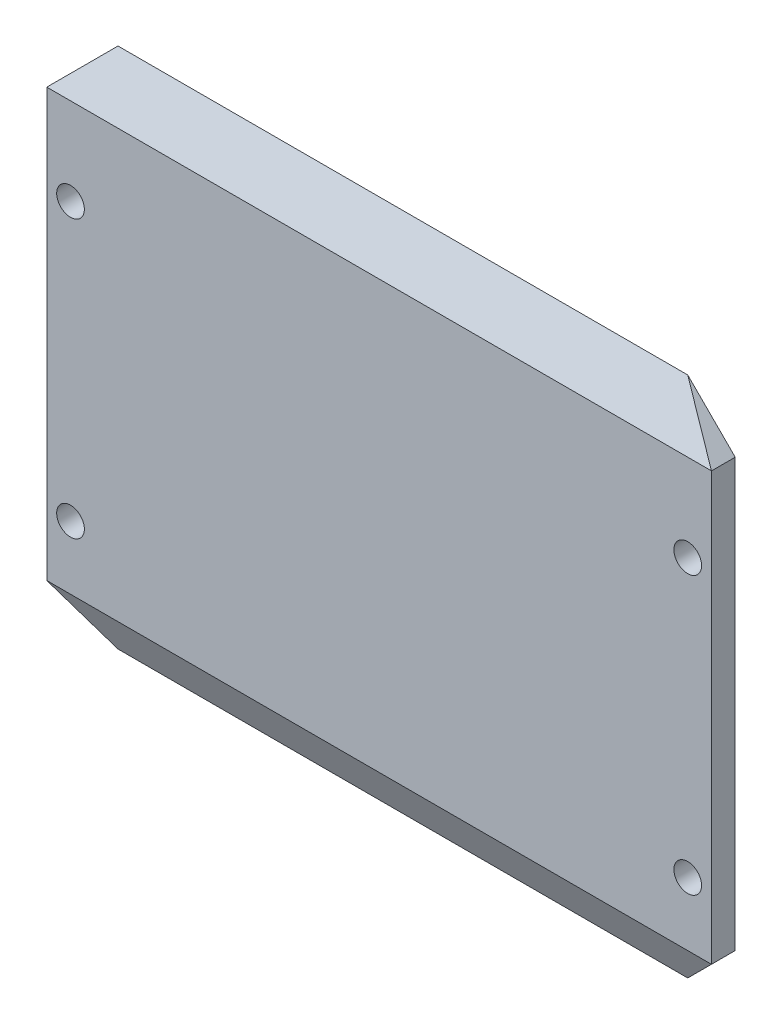
ISO-10303-21;
HEADER;
FILE_DESCRIPTION(('STEP AP214'),'2;1');
FILE_NAME('part.step','',(''),(''),'','','');
FILE_SCHEMA(('AUTOMOTIVE_DESIGN { 1 0 10303 214 1 1 1 1 }'));
ENDSEC;
DATA;
#1=APPLICATION_CONTEXT('core data for automotive mechanical design processes');
#2=APPLICATION_PROTOCOL_DEFINITION('international standard','automotive_design',2000,#1);
#3=PRODUCT_CONTEXT('',#1,'mechanical');
#4=PRODUCT('Part','Part','',(#3));
#5=PRODUCT_RELATED_PRODUCT_CATEGORY('part','',(#4));
#6=PRODUCT_DEFINITION_FORMATION('','',#4);
#7=PRODUCT_DEFINITION_CONTEXT('part definition',#1,'design');
#8=PRODUCT_DEFINITION('design','',#6,#7);
#9=PRODUCT_DEFINITION_SHAPE('','',#8);
#10=(LENGTH_UNIT() NAMED_UNIT(*) SI_UNIT(.MILLI.,.METRE.));
#11=(NAMED_UNIT(*) PLANE_ANGLE_UNIT() SI_UNIT($,.RADIAN.));
#12=(NAMED_UNIT(*) SI_UNIT($,.STERADIAN.) SOLID_ANGLE_UNIT());
#13=UNCERTAINTY_MEASURE_WITH_UNIT(LENGTH_MEASURE(1.E-05),#10,'distance_accuracy_value','');
#14=(GEOMETRIC_REPRESENTATION_CONTEXT(3) GLOBAL_UNCERTAINTY_ASSIGNED_CONTEXT((#13)) GLOBAL_UNIT_ASSIGNED_CONTEXT((#10,
#11,#12)) REPRESENTATION_CONTEXT('',''));
#15=CARTESIAN_POINT('',(0.,0.,0.));
#16=DIRECTION('',(0.,0.,1.));
#17=DIRECTION('',(1.,0.,0.));
#18=AXIS2_PLACEMENT_3D('',#15,#16,#17);
#19=CARTESIAN_POINT('',(42.,-33.,3.));
#20=DIRECTION('',(-1.,0.,0.));
#21=DIRECTION('',(0.,0.,1.));
#22=AXIS2_PLACEMENT_3D('',#19,#20,#21);
#23=PLANE('',#22);
#24=DIRECTION('',(0.,1.,0.));
#25=VECTOR('',#24,1.);
#26=CARTESIAN_POINT('',(42.,-33.,0.));
#27=LINE('',#26,#25);
#28=CARTESIAN_POINT('',(42.,-27.,0.));
#29=VERTEX_POINT('',#28);
#30=CARTESIAN_POINT('',(42.,27.,0.));
#31=VERTEX_POINT('',#30);
#32=EDGE_CURVE('E117',#29,#31,#27,.T.);
#33=ORIENTED_EDGE('',*,*,#32,.T.);
#34=DIRECTION('',(0.,0.,1.));
#35=VECTOR('',#34,1.);
#36=CARTESIAN_POINT('',(42.,27.,3.));
#37=LINE('',#36,#35);
#38=CARTESIAN_POINT('',(42.,27.,3.));
#39=VERTEX_POINT('',#38);
#40=EDGE_CURVE('E129',#31,#39,#37,.T.);
#41=ORIENTED_EDGE('',*,*,#40,.T.);
#42=DIRECTION('',(0.,1.,0.));
#43=VECTOR('',#42,1.);
#44=CARTESIAN_POINT('',(42.,-33.,3.));
#45=LINE('',#44,#43);
#46=CARTESIAN_POINT('',(42.,-27.,3.));
#47=VERTEX_POINT('',#46);
#48=EDGE_CURVE('E115',#47,#39,#45,.T.);
#49=ORIENTED_EDGE('',*,*,#48,.F.);
#50=DIRECTION('',(0.,0.,-1.));
#51=VECTOR('',#50,1.);
#52=CARTESIAN_POINT('',(42.,-27.,3.));
#53=LINE('',#52,#51);
#54=EDGE_CURVE('E95',#47,#29,#53,.T.);
#55=ORIENTED_EDGE('',*,*,#54,.T.);
#56=EDGE_LOOP('',(#33,#41,#49,#55));
#57=FACE_BOUND('',#56,.T.);
#58=ADVANCED_FACE('F33',(#57),#23,.F.);
#59=CARTESIAN_POINT('',(-42.,-33.,3.));
#60=DIRECTION('',(1.,0.,0.));
#61=DIRECTION('',(0.,0.,-1.));
#62=AXIS2_PLACEMENT_3D('',#59,#60,#61);
#63=PLANE('',#62);
#64=DIRECTION('',(0.,-1.,0.));
#65=VECTOR('',#64,1.);
#66=CARTESIAN_POINT('',(-42.,-33.,3.));
#67=LINE('',#66,#65);
#68=CARTESIAN_POINT('',(-42.,27.,3.));
#69=VERTEX_POINT('',#68);
#70=CARTESIAN_POINT('',(-42.,-27.,3.));
#71=VERTEX_POINT('',#70);
#72=EDGE_CURVE('E106',#69,#71,#67,.T.);
#73=ORIENTED_EDGE('',*,*,#72,.F.);
#74=DIRECTION('',(0.,0.,-1.));
#75=VECTOR('',#74,1.);
#76=CARTESIAN_POINT('',(-42.,27.,3.));
#77=LINE('',#76,#75);
#78=CARTESIAN_POINT('',(-42.,27.,0.));
#79=VERTEX_POINT('',#78);
#80=EDGE_CURVE('E89',#69,#79,#77,.T.);
#81=ORIENTED_EDGE('',*,*,#80,.T.);
#82=DIRECTION('',(0.,-1.,0.));
#83=VECTOR('',#82,1.);
#84=CARTESIAN_POINT('',(-42.,-33.,0.));
#85=LINE('',#84,#83);
#86=CARTESIAN_POINT('',(-42.,-27.,0.));
#87=VERTEX_POINT('',#86);
#88=EDGE_CURVE('E103',#79,#87,#85,.T.);
#89=ORIENTED_EDGE('',*,*,#88,.T.);
#90=DIRECTION('',(0.,0.,1.));
#91=VECTOR('',#90,1.);
#92=CARTESIAN_POINT('',(-42.,-27.,3.));
#93=LINE('',#92,#91);
#94=EDGE_CURVE('E108',#87,#71,#93,.T.);
#95=ORIENTED_EDGE('',*,*,#94,.T.);
#96=EDGE_LOOP('',(#73,#81,#89,#95));
#97=FACE_BOUND('',#96,.T.);
#98=ADVANCED_FACE('F101',(#97),#63,.F.);
#99=CARTESIAN_POINT('',(0.,0.,3.));
#100=DIRECTION('',(0.,0.,-1.));
#101=DIRECTION('',(-1.,0.,0.));
#102=AXIS2_PLACEMENT_3D('',#99,#100,#101);
#103=PLANE('',#102);
#104=CARTESIAN_POINT('',(39.,-19.,3.));
#105=DIRECTION('',(0.,0.,1.));
#106=DIRECTION('',(-1.,0.,0.));
#107=AXIS2_PLACEMENT_3D('',#104,#105,#106);
#108=CIRCLE('',#107,1.75);
#109=CARTESIAN_POINT('',(37.25,-19.,3.));
#110=VERTEX_POINT('',#109);
#111=EDGE_CURVE('E175',#110,#110,#108,.T.);
#112=ORIENTED_EDGE('',*,*,#111,.F.);
#113=EDGE_LOOP('',(#112));
#114=FACE_BOUND('',#113,.T.);
#115=CARTESIAN_POINT('',(39.,16.,3.));
#116=DIRECTION('',(0.,0.,1.));
#117=DIRECTION('',(1.,0.,0.));
#118=AXIS2_PLACEMENT_3D('',#115,#116,#117);
#119=CIRCLE('',#118,1.75);
#120=CARTESIAN_POINT('',(40.75,16.,3.));
#121=VERTEX_POINT('',#120);
#122=EDGE_CURVE('E169',#121,#121,#119,.T.);
#123=ORIENTED_EDGE('',*,*,#122,.F.);
#124=EDGE_LOOP('',(#123));
#125=FACE_BOUND('',#124,.T.);
#126=CARTESIAN_POINT('',(-39.,16.,3.));
#127=DIRECTION('',(0.,0.,1.));
#128=DIRECTION('',(-1.,0.,0.));
#129=AXIS2_PLACEMENT_3D('',#126,#127,#128);
#130=CIRCLE('',#129,1.75);
#131=CARTESIAN_POINT('',(-40.75,16.,3.));
#132=VERTEX_POINT('',#131);
#133=EDGE_CURVE('E163',#132,#132,#130,.T.);
#134=ORIENTED_EDGE('',*,*,#133,.F.);
#135=EDGE_LOOP('',(#134));
#136=FACE_BOUND('',#135,.T.);
#137=CARTESIAN_POINT('',(-39.,-19.,3.));
#138=DIRECTION('',(0.,0.,1.));
#139=DIRECTION('',(1.,0.,0.));
#140=AXIS2_PLACEMENT_3D('',#137,#138,#139);
#141=CIRCLE('',#140,1.75);
#142=CARTESIAN_POINT('',(-37.25,-19.,3.));
#143=VERTEX_POINT('',#142);
#144=EDGE_CURVE('E156',#143,#143,#141,.T.);
#145=ORIENTED_EDGE('',*,*,#144,.F.);
#146=EDGE_LOOP('',(#145));
#147=FACE_BOUND('',#146,.T.);
#148=ORIENTED_EDGE('',*,*,#48,.T.);
#149=DIRECTION('',(-1.,0.,0.));
#150=VECTOR('',#149,1.);
#151=CARTESIAN_POINT('',(0.,26.9999999999999,3.));
#152=LINE('',#151,#150);
#153=EDGE_CURVE('E133',#39,#69,#152,.T.);
#154=ORIENTED_EDGE('',*,*,#153,.T.);
#155=ORIENTED_EDGE('',*,*,#72,.T.);
#156=DIRECTION('',(1.,0.,0.));
#157=VECTOR('',#156,1.);
#158=CARTESIAN_POINT('',(0.,-27.,3.));
#159=LINE('',#158,#157);
#160=EDGE_CURVE('E131',#71,#47,#159,.T.);
#161=ORIENTED_EDGE('',*,*,#160,.T.);
#162=EDGE_LOOP('',(#148,#154,#155,#161));
#163=FACE_BOUND('',#162,.T.);
#164=ADVANCED_FACE('F147',(#114,#125,#136,#147,#163),#103,.F.);
#165=CARTESIAN_POINT('',(0.,0.,0.));
#166=DIRECTION('',(0.,0.,-1.));
#167=DIRECTION('',(-1.,0.,0.));
#168=AXIS2_PLACEMENT_3D('',#165,#166,#167);
#169=PLANE('',#168);
#170=CARTESIAN_POINT('',(39.,-19.,0.));
#171=DIRECTION('',(0.,0.,1.));
#172=DIRECTION('',(-1.,0.,0.));
#173=AXIS2_PLACEMENT_3D('',#170,#171,#172);
#174=CIRCLE('',#173,1.75);
#175=CARTESIAN_POINT('',(37.25,-19.,0.));
#176=VERTEX_POINT('',#175);
#177=EDGE_CURVE('E161',#176,#176,#174,.T.);
#178=ORIENTED_EDGE('',*,*,#177,.T.);
#179=EDGE_LOOP('',(#178));
#180=FACE_BOUND('',#179,.T.);
#181=CARTESIAN_POINT('',(39.,16.,0.));
#182=DIRECTION('',(0.,0.,1.));
#183=DIRECTION('',(1.,0.,0.));
#184=AXIS2_PLACEMENT_3D('',#181,#182,#183);
#185=CIRCLE('',#184,1.75);
#186=CARTESIAN_POINT('',(40.75,16.,0.));
#187=VERTEX_POINT('',#186);
#188=EDGE_CURVE('E172',#187,#187,#185,.T.);
#189=ORIENTED_EDGE('',*,*,#188,.T.);
#190=EDGE_LOOP('',(#189));
#191=FACE_BOUND('',#190,.T.);
#192=CARTESIAN_POINT('',(-39.,16.,0.));
#193=DIRECTION('',(0.,0.,1.));
#194=DIRECTION('',(-1.,0.,0.));
#195=AXIS2_PLACEMENT_3D('',#192,#193,#194);
#196=CIRCLE('',#195,1.75);
#197=CARTESIAN_POINT('',(-40.75,16.,0.));
#198=VERTEX_POINT('',#197);
#199=EDGE_CURVE('E166',#198,#198,#196,.T.);
#200=ORIENTED_EDGE('',*,*,#199,.T.);
#201=EDGE_LOOP('',(#200));
#202=FACE_BOUND('',#201,.T.);
#203=CARTESIAN_POINT('',(-39.,-19.,0.));
#204=DIRECTION('',(0.,0.,1.));
#205=DIRECTION('',(1.,0.,0.));
#206=AXIS2_PLACEMENT_3D('',#203,#204,#205);
#207=CIRCLE('',#206,1.75);
#208=CARTESIAN_POINT('',(-37.25,-19.,0.));
#209=VERTEX_POINT('',#208);
#210=EDGE_CURVE('E153',#209,#209,#207,.T.);
#211=ORIENTED_EDGE('',*,*,#210,.T.);
#212=EDGE_LOOP('',(#211));
#213=FACE_BOUND('',#212,.T.);
#214=ORIENTED_EDGE('',*,*,#88,.F.);
#215=DIRECTION('',(-0.707106781186548,-0.707106781186548,0.));
#216=VECTOR('',#215,1.);
#217=CARTESIAN_POINT('',(-34.5,34.5,0.));
#218=LINE('',#217,#216);
#219=CARTESIAN_POINT('',(-36.,33.,0.));
#220=VERTEX_POINT('',#219);
#221=EDGE_CURVE('E86',#79,#220,#218,.F.);
#222=ORIENTED_EDGE('',*,*,#221,.T.);
#223=DIRECTION('',(-1.,0.,0.));
#224=VECTOR('',#223,1.);
#225=CARTESIAN_POINT('',(-42.,33.,0.));
#226=LINE('',#225,#224);
#227=CARTESIAN_POINT('',(36.,33.,0.));
#228=VERTEX_POINT('',#227);
#229=EDGE_CURVE('E113',#228,#220,#226,.T.);
#230=ORIENTED_EDGE('',*,*,#229,.F.);
#231=DIRECTION('',(-0.707106781186548,0.707106781186548,0.));
#232=VECTOR('',#231,1.);
#233=CARTESIAN_POINT('',(34.5,34.5,0.));
#234=LINE('',#233,#232);
#235=EDGE_CURVE('E96',#228,#31,#234,.F.);
#236=ORIENTED_EDGE('',*,*,#235,.T.);
#237=ORIENTED_EDGE('',*,*,#32,.F.);
#238=DIRECTION('',(0.707106781186548,0.707106781186548,0.));
#239=VECTOR('',#238,1.);
#240=CARTESIAN_POINT('',(34.5,-34.5,0.));
#241=LINE('',#240,#239);
#242=CARTESIAN_POINT('',(36.,-33.,0.));
#243=VERTEX_POINT('',#242);
#244=EDGE_CURVE('E123',#29,#243,#241,.F.);
#245=ORIENTED_EDGE('',*,*,#244,.T.);
#246=DIRECTION('',(1.,0.,0.));
#247=VECTOR('',#246,1.);
#248=CARTESIAN_POINT('',(-42.,-33.,0.));
#249=LINE('',#248,#247);
#250=CARTESIAN_POINT('',(-36.,-33.,0.));
#251=VERTEX_POINT('',#250);
#252=EDGE_CURVE('E112',#251,#243,#249,.T.);
#253=ORIENTED_EDGE('',*,*,#252,.F.);
#254=DIRECTION('',(0.707106781186548,-0.707106781186548,0.));
#255=VECTOR('',#254,1.);
#256=CARTESIAN_POINT('',(-34.5,-34.5,0.));
#257=LINE('',#256,#255);
#258=EDGE_CURVE('E107',#251,#87,#257,.F.);
#259=ORIENTED_EDGE('',*,*,#258,.T.);
#260=EDGE_LOOP('',(#214,#222,#230,#236,#237,#245,#253,#259));
#261=FACE_BOUND('',#260,.T.);
#262=ADVANCED_FACE('F110',(#180,#191,#202,#213,#261),#169,.T.);
#263=CARTESIAN_POINT('',(-42.,27.,3.));
#264=DIRECTION('',(0.707106781186547,-0.707106781186547,0.));
#265=DIRECTION('',(0.,0.,-1.));
#266=AXIS2_PLACEMENT_3D('',#263,#264,#265);
#267=PLANE('',#266);
#268=ORIENTED_EDGE('',*,*,#80,.F.);
#269=DIRECTION('',(0.666666666666667,0.666666666666667,-0.333333333333333));
#270=VECTOR('',#269,1.);
#271=CARTESIAN_POINT('',(-42.,27.,2.99999999999998));
#272=LINE('',#271,#270);
#273=EDGE_CURVE('E90',#69,#220,#272,.T.);
#274=ORIENTED_EDGE('',*,*,#273,.T.);
#275=ORIENTED_EDGE('',*,*,#221,.F.);
#276=EDGE_LOOP('',(#268,#274,#275));
#277=FACE_BOUND('',#276,.T.);
#278=ADVANCED_FACE('F88',(#277),#267,.F.);
#279=CARTESIAN_POINT('',(36.,33.,3.));
#280=DIRECTION('',(-0.707106781186547,-0.707106781186547,0.));
#281=DIRECTION('',(0.,0.,-1.));
#282=AXIS2_PLACEMENT_3D('',#279,#280,#281);
#283=PLANE('',#282);
#284=ORIENTED_EDGE('',*,*,#235,.F.);
#285=DIRECTION('',(0.666666666666667,-0.666666666666667,0.333333333333333));
#286=VECTOR('',#285,1.);
#287=CARTESIAN_POINT('',(36.6666666666667,32.3333333333333,0.333333333333317));
#288=LINE('',#287,#286);
#289=EDGE_CURVE('E48',#228,#39,#288,.T.);
#290=ORIENTED_EDGE('',*,*,#289,.T.);
#291=ORIENTED_EDGE('',*,*,#40,.F.);
#292=EDGE_LOOP('',(#284,#290,#291));
#293=FACE_BOUND('',#292,.T.);
#294=ADVANCED_FACE('F221',(#293),#283,.F.);
#295=CARTESIAN_POINT('',(42.,-27.,3.));
#296=DIRECTION('',(-0.707106781186547,0.707106781186547,0.));
#297=DIRECTION('',(0.,0.,-1.));
#298=AXIS2_PLACEMENT_3D('',#295,#296,#297);
#299=PLANE('',#298);
#300=ORIENTED_EDGE('',*,*,#54,.F.);
#301=DIRECTION('',(-0.666666666666667,-0.666666666666667,-0.333333333333333));
#302=VECTOR('',#301,1.);
#303=CARTESIAN_POINT('',(42.,-27.,2.99999999999999));
#304=LINE('',#303,#302);
#305=EDGE_CURVE('E41',#47,#243,#304,.T.);
#306=ORIENTED_EDGE('',*,*,#305,.T.);
#307=ORIENTED_EDGE('',*,*,#244,.F.);
#308=EDGE_LOOP('',(#300,#306,#307));
#309=FACE_BOUND('',#308,.T.);
#310=ADVANCED_FACE('F139',(#309),#299,.F.);
#311=CARTESIAN_POINT('',(-36.,-33.,3.));
#312=DIRECTION('',(0.707106781186547,0.707106781186547,0.));
#313=DIRECTION('',(0.,0.,-1.));
#314=AXIS2_PLACEMENT_3D('',#311,#312,#313);
#315=PLANE('',#314);
#316=ORIENTED_EDGE('',*,*,#258,.F.);
#317=DIRECTION('',(-0.666666666666667,0.666666666666667,0.333333333333333));
#318=VECTOR('',#317,1.);
#319=CARTESIAN_POINT('',(-36.6666666666667,-32.3333333333333,0.33333333333333));
#320=LINE('',#319,#318);
#321=EDGE_CURVE('E11',#251,#71,#320,.T.);
#322=ORIENTED_EDGE('',*,*,#321,.T.);
#323=ORIENTED_EDGE('',*,*,#94,.F.);
#324=EDGE_LOOP('',(#316,#322,#323));
#325=FACE_BOUND('',#324,.T.);
#326=ADVANCED_FACE('F144',(#325),#315,.F.);
#327=CARTESIAN_POINT('',(0.,26.9999999999999,3.));
#328=DIRECTION('',(0.,-0.447213595499957,-0.894427190999916));
#329=DIRECTION('',(-1.,0.,0.));
#330=AXIS2_PLACEMENT_3D('',#327,#328,#329);
#331=PLANE('',#330);
#332=ORIENTED_EDGE('',*,*,#289,.F.);
#333=ORIENTED_EDGE('',*,*,#229,.T.);
#334=ORIENTED_EDGE('',*,*,#273,.F.);
#335=ORIENTED_EDGE('',*,*,#153,.F.);
#336=EDGE_LOOP('',(#332,#333,#334,#335));
#337=FACE_BOUND('',#336,.T.);
#338=ADVANCED_FACE('F210',(#337),#331,.F.);
#339=CARTESIAN_POINT('',(0.,-27.,3.));
#340=DIRECTION('',(0.,0.447213595499957,-0.894427190999916));
#341=DIRECTION('',(1.,0.,0.));
#342=AXIS2_PLACEMENT_3D('',#339,#340,#341);
#343=PLANE('',#342);
#344=ORIENTED_EDGE('',*,*,#321,.F.);
#345=ORIENTED_EDGE('',*,*,#252,.T.);
#346=ORIENTED_EDGE('',*,*,#305,.F.);
#347=ORIENTED_EDGE('',*,*,#160,.F.);
#348=EDGE_LOOP('',(#344,#345,#346,#347));
#349=FACE_BOUND('',#348,.T.);
#350=ADVANCED_FACE('F35',(#349),#343,.F.);
#351=CARTESIAN_POINT('',(-39.,-19.,0.));
#352=DIRECTION('',(0.,0.,1.));
#353=DIRECTION('',(1.,0.,0.));
#354=AXIS2_PLACEMENT_3D('',#351,#352,#353);
#355=CYLINDRICAL_SURFACE('',#354,1.75);
#356=ORIENTED_EDGE('',*,*,#210,.F.);
#357=EDGE_LOOP('',(#356));
#358=FACE_BOUND('',#357,.T.);
#359=ORIENTED_EDGE('',*,*,#144,.T.);
#360=EDGE_LOOP('',(#359));
#361=FACE_BOUND('',#360,.T.);
#362=ADVANCED_FACE('F199',(#358,#361),#355,.F.);
#363=CARTESIAN_POINT('',(-39.,16.,0.));
#364=DIRECTION('',(0.,0.,1.));
#365=DIRECTION('',(1.,0.,0.));
#366=AXIS2_PLACEMENT_3D('',#363,#364,#365);
#367=CYLINDRICAL_SURFACE('',#366,1.75);
#368=ORIENTED_EDGE('',*,*,#199,.F.);
#369=EDGE_LOOP('',(#368));
#370=FACE_BOUND('',#369,.T.);
#371=ORIENTED_EDGE('',*,*,#133,.T.);
#372=EDGE_LOOP('',(#371));
#373=FACE_BOUND('',#372,.T.);
#374=ADVANCED_FACE('F201',(#370,#373),#367,.F.);
#375=CARTESIAN_POINT('',(39.,16.,0.));
#376=DIRECTION('',(0.,0.,1.));
#377=DIRECTION('',(1.,0.,0.));
#378=AXIS2_PLACEMENT_3D('',#375,#376,#377);
#379=CYLINDRICAL_SURFACE('',#378,1.75);
#380=ORIENTED_EDGE('',*,*,#188,.F.);
#381=EDGE_LOOP('',(#380));
#382=FACE_BOUND('',#381,.T.);
#383=ORIENTED_EDGE('',*,*,#122,.T.);
#384=EDGE_LOOP('',(#383));
#385=FACE_BOUND('',#384,.T.);
#386=ADVANCED_FACE('F186',(#382,#385),#379,.F.);
#387=CARTESIAN_POINT('',(39.,-19.,0.));
#388=DIRECTION('',(0.,0.,1.));
#389=DIRECTION('',(1.,0.,0.));
#390=AXIS2_PLACEMENT_3D('',#387,#388,#389);
#391=CYLINDRICAL_SURFACE('',#390,1.75);
#392=ORIENTED_EDGE('',*,*,#177,.F.);
#393=EDGE_LOOP('',(#392));
#394=FACE_BOUND('',#393,.T.);
#395=ORIENTED_EDGE('',*,*,#111,.T.);
#396=EDGE_LOOP('',(#395));
#397=FACE_BOUND('',#396,.T.);
#398=ADVANCED_FACE('F183',(#394,#397),#391,.F.);
#399=CLOSED_SHELL('',(#58,#98,#164,#262,#278,#294,#310,#326,#338,#350,#362,#374,#386,#398));
#400=MANIFOLD_SOLID_BREP('B2',#399);
#401=ADVANCED_BREP_SHAPE_REPRESENTATION('',(#18,#400),#14);
#402=SHAPE_DEFINITION_REPRESENTATION(#9,#401);
ENDSEC;
END-ISO-10303-21;
